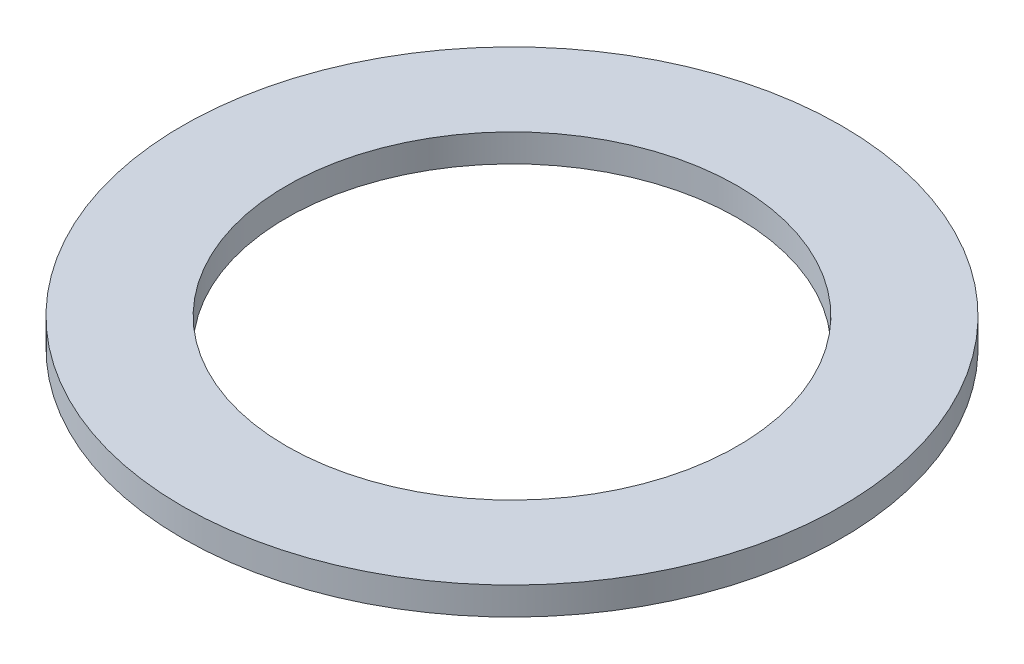
ISO-10303-21;
HEADER;
FILE_DESCRIPTION(('STEP AP214'),'2;1');
FILE_NAME('part.step','',(''),(''),'','','');
FILE_SCHEMA(('AUTOMOTIVE_DESIGN { 1 0 10303 214 1 1 1 1 }'));
ENDSEC;
DATA;
#1=APPLICATION_CONTEXT('core data for automotive mechanical design processes');
#2=APPLICATION_PROTOCOL_DEFINITION('international standard','automotive_design',2000,#1);
#3=PRODUCT_CONTEXT('',#1,'mechanical');
#4=PRODUCT('Part','Part','',(#3));
#5=PRODUCT_RELATED_PRODUCT_CATEGORY('part','',(#4));
#6=PRODUCT_DEFINITION_FORMATION('','',#4);
#7=PRODUCT_DEFINITION_CONTEXT('part definition',#1,'design');
#8=PRODUCT_DEFINITION('design','',#6,#7);
#9=PRODUCT_DEFINITION_SHAPE('','',#8);
#10=(LENGTH_UNIT() NAMED_UNIT(*) SI_UNIT(.MILLI.,.METRE.));
#11=(NAMED_UNIT(*) PLANE_ANGLE_UNIT() SI_UNIT($,.RADIAN.));
#12=(NAMED_UNIT(*) SI_UNIT($,.STERADIAN.) SOLID_ANGLE_UNIT());
#13=UNCERTAINTY_MEASURE_WITH_UNIT(LENGTH_MEASURE(1.E-05),#10,'distance_accuracy_value','');
#14=(GEOMETRIC_REPRESENTATION_CONTEXT(3) GLOBAL_UNCERTAINTY_ASSIGNED_CONTEXT((#13)) GLOBAL_UNIT_ASSIGNED_CONTEXT((#10,
#11,#12)) REPRESENTATION_CONTEXT('',''));
#15=CARTESIAN_POINT('',(0.,0.,0.));
#16=DIRECTION('',(0.,0.,1.));
#17=DIRECTION('',(1.,0.,0.));
#18=AXIS2_PLACEMENT_3D('',#15,#16,#17);
#19=CARTESIAN_POINT('',(0.,4.,0.));
#20=DIRECTION('',(0.,-1.,0.));
#21=DIRECTION('',(0.,0.,-1.));
#22=AXIS2_PLACEMENT_3D('',#19,#20,#21);
#23=CYLINDRICAL_SURFACE('',#22,47.5);
#24=CARTESIAN_POINT('',(0.,4.,0.));
#25=DIRECTION('',(0.,1.,0.));
#26=DIRECTION('',(0.,0.,1.));
#27=AXIS2_PLACEMENT_3D('',#24,#25,#26);
#28=CIRCLE('',#27,47.5);
#29=CARTESIAN_POINT('',(0.,4.,47.5));
#30=VERTEX_POINT('',#29);
#31=EDGE_CURVE('E10',#30,#30,#28,.T.);
#32=ORIENTED_EDGE('',*,*,#31,.F.);
#33=EDGE_LOOP('',(#32));
#34=FACE_BOUND('',#33,.T.);
#35=CARTESIAN_POINT('',(0.,0.,0.));
#36=DIRECTION('',(0.,1.,0.));
#37=DIRECTION('',(0.,0.,1.));
#38=AXIS2_PLACEMENT_3D('',#35,#36,#37);
#39=CIRCLE('',#38,47.5);
#40=CARTESIAN_POINT('',(0.,0.,47.5));
#41=VERTEX_POINT('',#40);
#42=EDGE_CURVE('E37',#41,#41,#39,.T.);
#43=ORIENTED_EDGE('',*,*,#42,.T.);
#44=EDGE_LOOP('',(#43));
#45=FACE_BOUND('',#44,.T.);
#46=ADVANCED_FACE('F40',(#34,#45),#23,.T.);
#47=CARTESIAN_POINT('',(0.,4.,0.));
#48=DIRECTION('',(0.,1.,0.));
#49=DIRECTION('',(0.,0.,1.));
#50=AXIS2_PLACEMENT_3D('',#47,#48,#49);
#51=PLANE('',#50);
#52=CARTESIAN_POINT('',(0.,4.,0.));
#53=DIRECTION('',(0.,1.,0.));
#54=DIRECTION('',(0.,0.,1.));
#55=AXIS2_PLACEMENT_3D('',#52,#53,#54);
#56=CIRCLE('',#55,32.5);
#57=CARTESIAN_POINT('',(0.,4.,32.5));
#58=VERTEX_POINT('',#57);
#59=EDGE_CURVE('E50',#58,#58,#56,.T.);
#60=ORIENTED_EDGE('',*,*,#59,.F.);
#61=EDGE_LOOP('',(#60));
#62=FACE_BOUND('',#61,.T.);
#63=ORIENTED_EDGE('',*,*,#31,.T.);
#64=EDGE_LOOP('',(#63));
#65=FACE_BOUND('',#64,.T.);
#66=ADVANCED_FACE('F59',(#62,#65),#51,.T.);
#67=CARTESIAN_POINT('',(0.,0.,0.));
#68=DIRECTION('',(0.,1.,0.));
#69=DIRECTION('',(0.,0.,1.));
#70=AXIS2_PLACEMENT_3D('',#67,#68,#69);
#71=PLANE('',#70);
#72=CARTESIAN_POINT('',(0.,0.,0.));
#73=DIRECTION('',(0.,1.,0.));
#74=DIRECTION('',(0.,0.,1.));
#75=AXIS2_PLACEMENT_3D('',#72,#73,#74);
#76=CIRCLE('',#75,32.5);
#77=CARTESIAN_POINT('',(0.,0.,32.5));
#78=VERTEX_POINT('',#77);
#79=EDGE_CURVE('E47',#78,#78,#76,.T.);
#80=ORIENTED_EDGE('',*,*,#79,.T.);
#81=EDGE_LOOP('',(#80));
#82=FACE_BOUND('',#81,.T.);
#83=ORIENTED_EDGE('',*,*,#42,.F.);
#84=EDGE_LOOP('',(#83));
#85=FACE_BOUND('',#84,.T.);
#86=ADVANCED_FACE('F58',(#82,#85),#71,.F.);
#87=CARTESIAN_POINT('',(0.,4.,0.));
#88=DIRECTION('',(0.,-1.,0.));
#89=DIRECTION('',(0.,0.,-1.));
#90=AXIS2_PLACEMENT_3D('',#87,#88,#89);
#91=CYLINDRICAL_SURFACE('',#90,32.5);
#92=ORIENTED_EDGE('',*,*,#59,.T.);
#93=EDGE_LOOP('',(#92));
#94=FACE_BOUND('',#93,.T.);
#95=ORIENTED_EDGE('',*,*,#79,.F.);
#96=EDGE_LOOP('',(#95));
#97=FACE_BOUND('',#96,.T.);
#98=ADVANCED_FACE('F54',(#94,#97),#91,.F.);
#99=CLOSED_SHELL('',(#46,#66,#86,#98));
#100=MANIFOLD_SOLID_BREP('B2',#99);
#101=ADVANCED_BREP_SHAPE_REPRESENTATION('',(#18,#100),#14);
#102=SHAPE_DEFINITION_REPRESENTATION(#9,#101);
ENDSEC;
END-ISO-10303-21;
